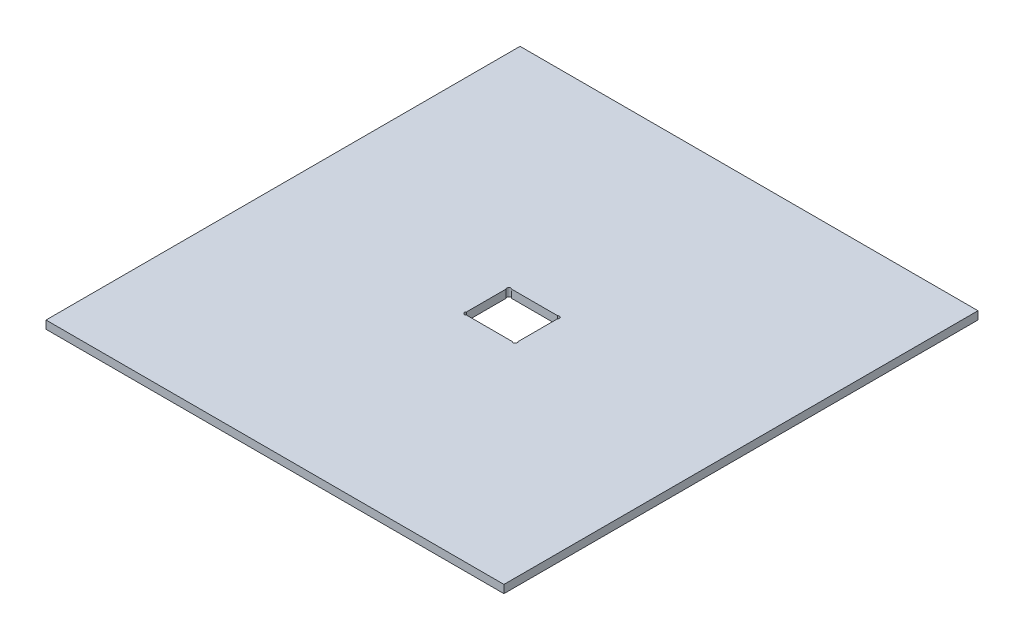
ISO-10303-21;
HEADER;
FILE_DESCRIPTION(('STEP AP214'),'2;1');
FILE_NAME('part.step','',(''),(''),'','','');
FILE_SCHEMA(('AUTOMOTIVE_DESIGN { 1 0 10303 214 1 1 1 1 }'));
ENDSEC;
DATA;
#1=APPLICATION_CONTEXT('core data for automotive mechanical design processes');
#2=APPLICATION_PROTOCOL_DEFINITION('international standard','automotive_design',2000,#1);
#3=PRODUCT_CONTEXT('',#1,'mechanical');
#4=PRODUCT('Part','Part','',(#3));
#5=PRODUCT_RELATED_PRODUCT_CATEGORY('part','',(#4));
#6=PRODUCT_DEFINITION_FORMATION('','',#4);
#7=PRODUCT_DEFINITION_CONTEXT('part definition',#1,'design');
#8=PRODUCT_DEFINITION('design','',#6,#7);
#9=PRODUCT_DEFINITION_SHAPE('','',#8);
#10=(LENGTH_UNIT() NAMED_UNIT(*) SI_UNIT(.MILLI.,.METRE.));
#11=(NAMED_UNIT(*) PLANE_ANGLE_UNIT() SI_UNIT($,.RADIAN.));
#12=(NAMED_UNIT(*) SI_UNIT($,.STERADIAN.) SOLID_ANGLE_UNIT());
#13=UNCERTAINTY_MEASURE_WITH_UNIT(LENGTH_MEASURE(1.E-05),#10,'distance_accuracy_value','');
#14=(GEOMETRIC_REPRESENTATION_CONTEXT(3) GLOBAL_UNCERTAINTY_ASSIGNED_CONTEXT((#13)) GLOBAL_UNIT_ASSIGNED_CONTEXT((#10,
#11,#12)) REPRESENTATION_CONTEXT('',''));
#15=CARTESIAN_POINT('',(0.,0.,0.));
#16=DIRECTION('',(0.,0.,1.));
#17=DIRECTION('',(1.,0.,0.));
#18=AXIS2_PLACEMENT_3D('',#15,#16,#17);
#19=CARTESIAN_POINT('',(0.,3.175,0.));
#20=DIRECTION('',(0.,-1.,0.));
#21=DIRECTION('',(0.,0.,-1.));
#22=AXIS2_PLACEMENT_3D('',#19,#20,#21);
#23=PLANE('',#22);
#24=DIRECTION('',(-1.,0.,0.));
#25=VECTOR('',#24,1.);
#26=CARTESIAN_POINT('',(80.3275,3.175,-102.5525));
#27=LINE('',#26,#25);
#28=CARTESIAN_POINT('',(99.5249679848664,3.175,-102.5525));
#29=VERTEX_POINT('',#28);
#30=CARTESIAN_POINT('',(81.4500320151336,3.175,-102.5525));
#31=VERTEX_POINT('',#30);
#32=EDGE_CURVE('E236',#29,#31,#27,.T.);
#33=ORIENTED_EDGE('',*,*,#32,.F.);
#34=CARTESIAN_POINT('',(100.086233992433,3.175,-101.991233992433));
#35=DIRECTION('',(0.,1.,0.));
#36=DIRECTION('',(0.,0.,1.));
#37=AXIS2_PLACEMENT_3D('',#34,#35,#36);
#38=CIRCLE('',#37,0.793749999999993);
#39=CARTESIAN_POINT('',(100.6475,3.175,-101.429967984866));
#40=VERTEX_POINT('',#39);
#41=EDGE_CURVE('E183',#40,#29,#38,.T.);
#42=ORIENTED_EDGE('',*,*,#41,.F.);
#43=DIRECTION('',(0.,0.,-1.));
#44=VECTOR('',#43,1.);
#45=CARTESIAN_POINT('',(100.6475,3.175,-84.7725));
#46=LINE('',#45,#44);
#47=CARTESIAN_POINT('',(100.6475,3.175,-85.8950320151336));
#48=VERTEX_POINT('',#47);
#49=EDGE_CURVE('E214',#48,#40,#46,.T.);
#50=ORIENTED_EDGE('',*,*,#49,.F.);
#51=CARTESIAN_POINT('',(100.086233992433,3.175,-85.3337660075668));
#52=DIRECTION('',(0.,1.,0.));
#53=DIRECTION('',(0.,0.,1.));
#54=AXIS2_PLACEMENT_3D('',#51,#52,#53);
#55=CIRCLE('',#54,0.793749999999993);
#56=CARTESIAN_POINT('',(99.5249679848664,3.175,-84.7725));
#57=VERTEX_POINT('',#56);
#58=EDGE_CURVE('E168',#57,#48,#55,.T.);
#59=ORIENTED_EDGE('',*,*,#58,.F.);
#60=DIRECTION('',(1.,0.,0.));
#61=VECTOR('',#60,1.);
#62=CARTESIAN_POINT('',(80.3275,3.175,-84.7725));
#63=LINE('',#62,#61);
#64=CARTESIAN_POINT('',(81.4500320151336,3.175,-84.7725));
#65=VERTEX_POINT('',#64);
#66=EDGE_CURVE('E220',#65,#57,#63,.T.);
#67=ORIENTED_EDGE('',*,*,#66,.F.);
#68=CARTESIAN_POINT('',(80.8887660075668,3.175,-85.3337660075668));
#69=DIRECTION('',(0.,1.,0.));
#70=DIRECTION('',(0.,0.,1.));
#71=AXIS2_PLACEMENT_3D('',#68,#69,#70);
#72=CIRCLE('',#71,0.793749999999993);
#73=CARTESIAN_POINT('',(80.3275,3.175,-85.8950320151336));
#74=VERTEX_POINT('',#73);
#75=EDGE_CURVE('E176',#74,#65,#72,.T.);
#76=ORIENTED_EDGE('',*,*,#75,.F.);
#77=DIRECTION('',(0.,0.,1.));
#78=VECTOR('',#77,1.);
#79=CARTESIAN_POINT('',(80.3275,3.175,-84.7725));
#80=LINE('',#79,#78);
#81=CARTESIAN_POINT('',(80.3275,3.175,-101.429967984866));
#82=VERTEX_POINT('',#81);
#83=EDGE_CURVE('E240',#82,#74,#80,.T.);
#84=ORIENTED_EDGE('',*,*,#83,.F.);
#85=CARTESIAN_POINT('',(80.8887660075668,3.175,-101.991233992433));
#86=DIRECTION('',(0.,1.,0.));
#87=DIRECTION('',(0.,0.,1.));
#88=AXIS2_PLACEMENT_3D('',#85,#86,#87);
#89=CIRCLE('',#88,0.793749999999993);
#90=EDGE_CURVE('E182',#31,#82,#89,.T.);
#91=ORIENTED_EDGE('',*,*,#90,.F.);
#92=EDGE_LOOP('',(#33,#42,#50,#59,#67,#76,#84,#91));
#93=FACE_BOUND('',#92,.T.);
#94=DIRECTION('',(0.,0.,1.));
#95=VECTOR('',#94,1.);
#96=CARTESIAN_POINT('',(0.1016,3.175,-187.2234));
#97=LINE('',#96,#95);
#98=CARTESIAN_POINT('',(0.1016,3.175,-187.2234));
#99=VERTEX_POINT('',#98);
#100=CARTESIAN_POINT('',(0.1016,3.175,-0.1016));
#101=VERTEX_POINT('',#100);
#102=EDGE_CURVE('E155',#99,#101,#97,.T.);
#103=ORIENTED_EDGE('',*,*,#102,.T.);
#104=DIRECTION('',(1.,0.,0.));
#105=VECTOR('',#104,1.);
#106=CARTESIAN_POINT('',(0.1016,3.175,-0.1016));
#107=LINE('',#106,#105);
#108=CARTESIAN_POINT('',(180.8734,3.175,-0.1016));
#109=VERTEX_POINT('',#108);
#110=EDGE_CURVE('E159',#101,#109,#107,.T.);
#111=ORIENTED_EDGE('',*,*,#110,.T.);
#112=DIRECTION('',(0.,0.,-1.));
#113=VECTOR('',#112,1.);
#114=CARTESIAN_POINT('',(180.8734,3.175,-0.1016));
#115=LINE('',#114,#113);
#116=CARTESIAN_POINT('',(180.8734,3.175,-187.2234));
#117=VERTEX_POINT('',#116);
#118=EDGE_CURVE('E54',#109,#117,#115,.T.);
#119=ORIENTED_EDGE('',*,*,#118,.T.);
#120=DIRECTION('',(-1.,0.,0.));
#121=VECTOR('',#120,1.);
#122=CARTESIAN_POINT('',(180.8734,3.175,-187.2234));
#123=LINE('',#122,#121);
#124=EDGE_CURVE('E134',#117,#99,#123,.T.);
#125=ORIENTED_EDGE('',*,*,#124,.T.);
#126=EDGE_LOOP('',(#103,#111,#119,#125));
#127=FACE_BOUND('',#126,.T.);
#128=ADVANCED_FACE('F38',(#93,#127),#23,.F.);
#129=CARTESIAN_POINT('',(0.,0.,0.));
#130=DIRECTION('',(0.,-1.,0.));
#131=DIRECTION('',(0.,0.,-1.));
#132=AXIS2_PLACEMENT_3D('',#129,#130,#131);
#133=PLANE('',#132);
#134=CARTESIAN_POINT('',(100.086233992433,0.,-101.991233992433));
#135=DIRECTION('',(0.,1.,0.));
#136=DIRECTION('',(0.,0.,1.));
#137=AXIS2_PLACEMENT_3D('',#134,#135,#136);
#138=CIRCLE('',#137,0.793749999999993);
#139=CARTESIAN_POINT('',(100.6475,0.,-101.429967984866));
#140=VERTEX_POINT('',#139);
#141=CARTESIAN_POINT('',(99.5249679848664,0.,-102.5525));
#142=VERTEX_POINT('',#141);
#143=EDGE_CURVE('E179',#140,#142,#138,.T.);
#144=ORIENTED_EDGE('',*,*,#143,.T.);
#145=DIRECTION('',(-1.,0.,0.));
#146=VECTOR('',#145,1.);
#147=CARTESIAN_POINT('',(80.3275,0.,-102.5525));
#148=LINE('',#147,#146);
#149=CARTESIAN_POINT('',(81.4500320151336,0.,-102.5525));
#150=VERTEX_POINT('',#149);
#151=EDGE_CURVE('E219',#142,#150,#148,.T.);
#152=ORIENTED_EDGE('',*,*,#151,.T.);
#153=CARTESIAN_POINT('',(80.8887660075668,0.,-101.991233992433));
#154=DIRECTION('',(0.,1.,0.));
#155=DIRECTION('',(0.,0.,1.));
#156=AXIS2_PLACEMENT_3D('',#153,#154,#155);
#157=CIRCLE('',#156,0.793749999999993);
#158=CARTESIAN_POINT('',(80.3275,0.,-101.429967984866));
#159=VERTEX_POINT('',#158);
#160=EDGE_CURVE('E192',#150,#159,#157,.T.);
#161=ORIENTED_EDGE('',*,*,#160,.T.);
#162=DIRECTION('',(0.,0.,1.));
#163=VECTOR('',#162,1.);
#164=CARTESIAN_POINT('',(80.3275,0.,-84.7725));
#165=LINE('',#164,#163);
#166=CARTESIAN_POINT('',(80.3275,0.,-85.8950320151336));
#167=VERTEX_POINT('',#166);
#168=EDGE_CURVE('E224',#159,#167,#165,.T.);
#169=ORIENTED_EDGE('',*,*,#168,.T.);
#170=CARTESIAN_POINT('',(80.8887660075668,0.,-85.3337660075668));
#171=DIRECTION('',(0.,1.,0.));
#172=DIRECTION('',(0.,0.,1.));
#173=AXIS2_PLACEMENT_3D('',#170,#171,#172);
#174=CIRCLE('',#173,0.793749999999993);
#175=CARTESIAN_POINT('',(81.4500320151336,0.,-84.7725));
#176=VERTEX_POINT('',#175);
#177=EDGE_CURVE('E186',#167,#176,#174,.T.);
#178=ORIENTED_EDGE('',*,*,#177,.T.);
#179=DIRECTION('',(1.,0.,0.));
#180=VECTOR('',#179,1.);
#181=CARTESIAN_POINT('',(80.3275,0.,-84.7725));
#182=LINE('',#181,#180);
#183=CARTESIAN_POINT('',(99.5249679848664,0.,-84.7725));
#184=VERTEX_POINT('',#183);
#185=EDGE_CURVE('E228',#176,#184,#182,.T.);
#186=ORIENTED_EDGE('',*,*,#185,.T.);
#187=CARTESIAN_POINT('',(100.086233992433,0.,-85.3337660075668));
#188=DIRECTION('',(0.,1.,0.));
#189=DIRECTION('',(0.,0.,1.));
#190=AXIS2_PLACEMENT_3D('',#187,#188,#189);
#191=CIRCLE('',#190,0.793749999999993);
#192=CARTESIAN_POINT('',(100.6475,0.,-85.8950320151336));
#193=VERTEX_POINT('',#192);
#194=EDGE_CURVE('E172',#184,#193,#191,.T.);
#195=ORIENTED_EDGE('',*,*,#194,.T.);
#196=DIRECTION('',(0.,0.,-1.));
#197=VECTOR('',#196,1.);
#198=CARTESIAN_POINT('',(100.6475,0.,-84.7725));
#199=LINE('',#198,#197);
#200=EDGE_CURVE('E215',#193,#140,#199,.T.);
#201=ORIENTED_EDGE('',*,*,#200,.T.);
#202=EDGE_LOOP('',(#144,#152,#161,#169,#178,#186,#195,#201));
#203=FACE_BOUND('',#202,.T.);
#204=DIRECTION('',(1.,0.,0.));
#205=VECTOR('',#204,1.);
#206=CARTESIAN_POINT('',(0.1016,0.,-0.1016));
#207=LINE('',#206,#205);
#208=CARTESIAN_POINT('',(0.1016,0.,-0.1016));
#209=VERTEX_POINT('',#208);
#210=CARTESIAN_POINT('',(180.8734,0.,-0.1016));
#211=VERTEX_POINT('',#210);
#212=EDGE_CURVE('E146',#209,#211,#207,.T.);
#213=ORIENTED_EDGE('',*,*,#212,.F.);
#214=DIRECTION('',(0.,0.,1.));
#215=VECTOR('',#214,1.);
#216=CARTESIAN_POINT('',(0.1016,0.,-187.2234));
#217=LINE('',#216,#215);
#218=CARTESIAN_POINT('',(0.1016,0.,-187.2234));
#219=VERTEX_POINT('',#218);
#220=EDGE_CURVE('E62',#219,#209,#217,.T.);
#221=ORIENTED_EDGE('',*,*,#220,.F.);
#222=DIRECTION('',(-1.,0.,0.));
#223=VECTOR('',#222,1.);
#224=CARTESIAN_POINT('',(180.8734,0.,-187.2234));
#225=LINE('',#224,#223);
#226=CARTESIAN_POINT('',(180.8734,0.,-187.2234));
#227=VERTEX_POINT('',#226);
#228=EDGE_CURVE('E132',#227,#219,#225,.T.);
#229=ORIENTED_EDGE('',*,*,#228,.F.);
#230=DIRECTION('',(0.,0.,-1.));
#231=VECTOR('',#230,1.);
#232=CARTESIAN_POINT('',(180.8734,0.,-0.1016));
#233=LINE('',#232,#231);
#234=EDGE_CURVE('E140',#211,#227,#233,.T.);
#235=ORIENTED_EDGE('',*,*,#234,.F.);
#236=EDGE_LOOP('',(#213,#221,#229,#235));
#237=FACE_BOUND('',#236,.T.);
#238=ADVANCED_FACE('F40',(#203,#237),#133,.T.);
#239=CARTESIAN_POINT('',(100.6475,0.,-84.7725));
#240=DIRECTION('',(1.,0.,0.));
#241=DIRECTION('',(0.,0.,-1.));
#242=AXIS2_PLACEMENT_3D('',#239,#240,#241);
#243=PLANE('',#242);
#244=ORIENTED_EDGE('',*,*,#49,.T.);
#245=DIRECTION('',(0.,1.,0.));
#246=VECTOR('',#245,1.);
#247=CARTESIAN_POINT('',(100.6475,0.,-101.429967984866));
#248=LINE('',#247,#246);
#249=EDGE_CURVE('E202',#40,#140,#248,.F.);
#250=ORIENTED_EDGE('',*,*,#249,.T.);
#251=ORIENTED_EDGE('',*,*,#200,.F.);
#252=DIRECTION('',(0.,1.,0.));
#253=VECTOR('',#252,1.);
#254=CARTESIAN_POINT('',(100.6475,0.,-85.8950320151336));
#255=LINE('',#254,#253);
#256=EDGE_CURVE('E210',#193,#48,#255,.T.);
#257=ORIENTED_EDGE('',*,*,#256,.T.);
#258=EDGE_LOOP('',(#244,#250,#251,#257));
#259=FACE_BOUND('',#258,.T.);
#260=ADVANCED_FACE('F283',(#259),#243,.F.);
#261=CARTESIAN_POINT('',(80.3275,0.,-84.7725));
#262=DIRECTION('',(0.,0.,1.));
#263=DIRECTION('',(1.,0.,0.));
#264=AXIS2_PLACEMENT_3D('',#261,#262,#263);
#265=PLANE('',#264);
#266=ORIENTED_EDGE('',*,*,#185,.F.);
#267=DIRECTION('',(0.,1.,0.));
#268=VECTOR('',#267,1.);
#269=CARTESIAN_POINT('',(81.4500320151336,0.,-84.7725));
#270=LINE('',#269,#268);
#271=EDGE_CURVE('E206',#176,#65,#270,.T.);
#272=ORIENTED_EDGE('',*,*,#271,.T.);
#273=ORIENTED_EDGE('',*,*,#66,.T.);
#274=DIRECTION('',(0.,1.,0.));
#275=VECTOR('',#274,1.);
#276=CARTESIAN_POINT('',(99.5249679848664,0.,-84.7725));
#277=LINE('',#276,#275);
#278=EDGE_CURVE('E11',#57,#184,#277,.F.);
#279=ORIENTED_EDGE('',*,*,#278,.T.);
#280=EDGE_LOOP('',(#266,#272,#273,#279));
#281=FACE_BOUND('',#280,.T.);
#282=ADVANCED_FACE('F278',(#281),#265,.F.);
#283=CARTESIAN_POINT('',(80.3275,0.,-84.7725));
#284=DIRECTION('',(-1.,0.,0.));
#285=DIRECTION('',(0.,0.,1.));
#286=AXIS2_PLACEMENT_3D('',#283,#284,#285);
#287=PLANE('',#286);
#288=ORIENTED_EDGE('',*,*,#83,.T.);
#289=DIRECTION('',(0.,1.,0.));
#290=VECTOR('',#289,1.);
#291=CARTESIAN_POINT('',(80.3275,0.,-85.8950320151336));
#292=LINE('',#291,#290);
#293=EDGE_CURVE('E47',#74,#167,#292,.F.);
#294=ORIENTED_EDGE('',*,*,#293,.T.);
#295=ORIENTED_EDGE('',*,*,#168,.F.);
#296=DIRECTION('',(0.,1.,0.));
#297=VECTOR('',#296,1.);
#298=CARTESIAN_POINT('',(80.3275,0.,-101.429967984866));
#299=LINE('',#298,#297);
#300=EDGE_CURVE('E196',#159,#82,#299,.T.);
#301=ORIENTED_EDGE('',*,*,#300,.T.);
#302=EDGE_LOOP('',(#288,#294,#295,#301));
#303=FACE_BOUND('',#302,.T.);
#304=ADVANCED_FACE('F258',(#303),#287,.F.);
#305=CARTESIAN_POINT('',(80.3275,0.,-102.5525));
#306=DIRECTION('',(0.,0.,-1.));
#307=DIRECTION('',(-1.,0.,0.));
#308=AXIS2_PLACEMENT_3D('',#305,#306,#307);
#309=PLANE('',#308);
#310=ORIENTED_EDGE('',*,*,#151,.F.);
#311=DIRECTION('',(0.,1.,0.));
#312=VECTOR('',#311,1.);
#313=CARTESIAN_POINT('',(99.5249679848664,0.,-102.5525));
#314=LINE('',#313,#312);
#315=EDGE_CURVE('E250',#142,#29,#314,.T.);
#316=ORIENTED_EDGE('',*,*,#315,.T.);
#317=ORIENTED_EDGE('',*,*,#32,.T.);
#318=DIRECTION('',(0.,1.,0.));
#319=VECTOR('',#318,1.);
#320=CARTESIAN_POINT('',(81.4500320151336,0.,-102.5525));
#321=LINE('',#320,#319);
#322=EDGE_CURVE('E232',#31,#150,#321,.F.);
#323=ORIENTED_EDGE('',*,*,#322,.T.);
#324=EDGE_LOOP('',(#310,#316,#317,#323));
#325=FACE_BOUND('',#324,.T.);
#326=ADVANCED_FACE('F268',(#325),#309,.F.);
#327=CARTESIAN_POINT('',(80.8887660075668,0.,-101.991233992433));
#328=DIRECTION('',(0.,1.,0.));
#329=DIRECTION('',(0.,0.,1.));
#330=AXIS2_PLACEMENT_3D('',#327,#328,#329);
#331=CYLINDRICAL_SURFACE('',#330,0.793749999999993);
#332=ORIENTED_EDGE('',*,*,#160,.F.);
#333=ORIENTED_EDGE('',*,*,#322,.F.);
#334=ORIENTED_EDGE('',*,*,#90,.T.);
#335=ORIENTED_EDGE('',*,*,#300,.F.);
#336=EDGE_LOOP('',(#332,#333,#334,#335));
#337=FACE_BOUND('',#336,.T.);
#338=ADVANCED_FACE('F266',(#337),#331,.F.);
#339=CARTESIAN_POINT('',(100.086233992433,0.,-101.991233992433));
#340=DIRECTION('',(0.,1.,0.));
#341=DIRECTION('',(0.,0.,1.));
#342=AXIS2_PLACEMENT_3D('',#339,#340,#341);
#343=CYLINDRICAL_SURFACE('',#342,0.793749999999993);
#344=ORIENTED_EDGE('',*,*,#41,.T.);
#345=ORIENTED_EDGE('',*,*,#315,.F.);
#346=ORIENTED_EDGE('',*,*,#143,.F.);
#347=ORIENTED_EDGE('',*,*,#249,.F.);
#348=EDGE_LOOP('',(#344,#345,#346,#347));
#349=FACE_BOUND('',#348,.T.);
#350=ADVANCED_FACE('F285',(#349),#343,.F.);
#351=CARTESIAN_POINT('',(80.8887660075668,0.,-85.3337660075668));
#352=DIRECTION('',(0.,1.,0.));
#353=DIRECTION('',(0.,0.,1.));
#354=AXIS2_PLACEMENT_3D('',#351,#352,#353);
#355=CYLINDRICAL_SURFACE('',#354,0.793749999999993);
#356=ORIENTED_EDGE('',*,*,#177,.F.);
#357=ORIENTED_EDGE('',*,*,#293,.F.);
#358=ORIENTED_EDGE('',*,*,#75,.T.);
#359=ORIENTED_EDGE('',*,*,#271,.F.);
#360=EDGE_LOOP('',(#356,#357,#358,#359));
#361=FACE_BOUND('',#360,.T.);
#362=ADVANCED_FACE('F276',(#361),#355,.F.);
#363=CARTESIAN_POINT('',(100.086233992433,0.,-85.3337660075668));
#364=DIRECTION('',(0.,1.,0.));
#365=DIRECTION('',(0.,0.,1.));
#366=AXIS2_PLACEMENT_3D('',#363,#364,#365);
#367=CYLINDRICAL_SURFACE('',#366,0.793749999999993);
#368=ORIENTED_EDGE('',*,*,#194,.F.);
#369=ORIENTED_EDGE('',*,*,#278,.F.);
#370=ORIENTED_EDGE('',*,*,#58,.T.);
#371=ORIENTED_EDGE('',*,*,#256,.F.);
#372=EDGE_LOOP('',(#368,#369,#370,#371));
#373=FACE_BOUND('',#372,.T.);
#374=ADVANCED_FACE('F292',(#373),#367,.F.);
#375=CARTESIAN_POINT('',(0.1016,0.,-187.2234));
#376=DIRECTION('',(-1.,0.,0.));
#377=DIRECTION('',(0.,0.,1.));
#378=AXIS2_PLACEMENT_3D('',#375,#376,#377);
#379=PLANE('',#378);
#380=ORIENTED_EDGE('',*,*,#102,.F.);
#381=DIRECTION('',(0.,1.,0.));
#382=VECTOR('',#381,1.);
#383=CARTESIAN_POINT('',(0.1016,0.,-187.2234));
#384=LINE('',#383,#382);
#385=EDGE_CURVE('E136',#219,#99,#384,.T.);
#386=ORIENTED_EDGE('',*,*,#385,.F.);
#387=ORIENTED_EDGE('',*,*,#220,.T.);
#388=DIRECTION('',(0.,1.,0.));
#389=VECTOR('',#388,1.);
#390=CARTESIAN_POINT('',(0.1016,0.,-0.1016));
#391=LINE('',#390,#389);
#392=EDGE_CURVE('E149',#209,#101,#391,.T.);
#393=ORIENTED_EDGE('',*,*,#392,.T.);
#394=EDGE_LOOP('',(#380,#386,#387,#393));
#395=FACE_BOUND('',#394,.T.);
#396=ADVANCED_FACE('F342',(#395),#379,.T.);
#397=CARTESIAN_POINT('',(180.8734,0.,-187.2234));
#398=DIRECTION('',(0.,0.,-1.));
#399=DIRECTION('',(-1.,0.,0.));
#400=AXIS2_PLACEMENT_3D('',#397,#398,#399);
#401=PLANE('',#400);
#402=ORIENTED_EDGE('',*,*,#124,.F.);
#403=DIRECTION('',(0.,1.,0.));
#404=VECTOR('',#403,1.);
#405=CARTESIAN_POINT('',(180.8734,0.,-187.2234));
#406=LINE('',#405,#404);
#407=EDGE_CURVE('E128',#227,#117,#406,.T.);
#408=ORIENTED_EDGE('',*,*,#407,.F.);
#409=ORIENTED_EDGE('',*,*,#228,.T.);
#410=ORIENTED_EDGE('',*,*,#385,.T.);
#411=EDGE_LOOP('',(#402,#408,#409,#410));
#412=FACE_BOUND('',#411,.T.);
#413=ADVANCED_FACE('F130',(#412),#401,.T.);
#414=CARTESIAN_POINT('',(180.8734,0.,-0.1016));
#415=DIRECTION('',(1.,0.,0.));
#416=DIRECTION('',(0.,0.,-1.));
#417=AXIS2_PLACEMENT_3D('',#414,#415,#416);
#418=PLANE('',#417);
#419=ORIENTED_EDGE('',*,*,#118,.F.);
#420=DIRECTION('',(0.,1.,0.));
#421=VECTOR('',#420,1.);
#422=CARTESIAN_POINT('',(180.8734,0.,-0.1016));
#423=LINE('',#422,#421);
#424=EDGE_CURVE('E137',#211,#109,#423,.T.);
#425=ORIENTED_EDGE('',*,*,#424,.F.);
#426=ORIENTED_EDGE('',*,*,#234,.T.);
#427=ORIENTED_EDGE('',*,*,#407,.T.);
#428=EDGE_LOOP('',(#419,#425,#426,#427));
#429=FACE_BOUND('',#428,.T.);
#430=ADVANCED_FACE('F141',(#429),#418,.T.);
#431=CARTESIAN_POINT('',(0.1016,0.,-0.1016));
#432=DIRECTION('',(0.,0.,1.));
#433=DIRECTION('',(1.,0.,0.));
#434=AXIS2_PLACEMENT_3D('',#431,#432,#433);
#435=PLANE('',#434);
#436=ORIENTED_EDGE('',*,*,#110,.F.);
#437=ORIENTED_EDGE('',*,*,#392,.F.);
#438=ORIENTED_EDGE('',*,*,#212,.T.);
#439=ORIENTED_EDGE('',*,*,#424,.T.);
#440=EDGE_LOOP('',(#436,#437,#438,#439));
#441=FACE_BOUND('',#440,.T.);
#442=ADVANCED_FACE('F377',(#441),#435,.T.);
#443=CLOSED_SHELL('',(#128,#238,#260,#282,#304,#326,#338,#350,#362,#374,#396,#413,#430,#442));
#444=MANIFOLD_SOLID_BREP('B2',#443);
#445=ADVANCED_BREP_SHAPE_REPRESENTATION('',(#18,#444),#14);
#446=SHAPE_DEFINITION_REPRESENTATION(#9,#445);
ENDSEC;
END-ISO-10303-21;
